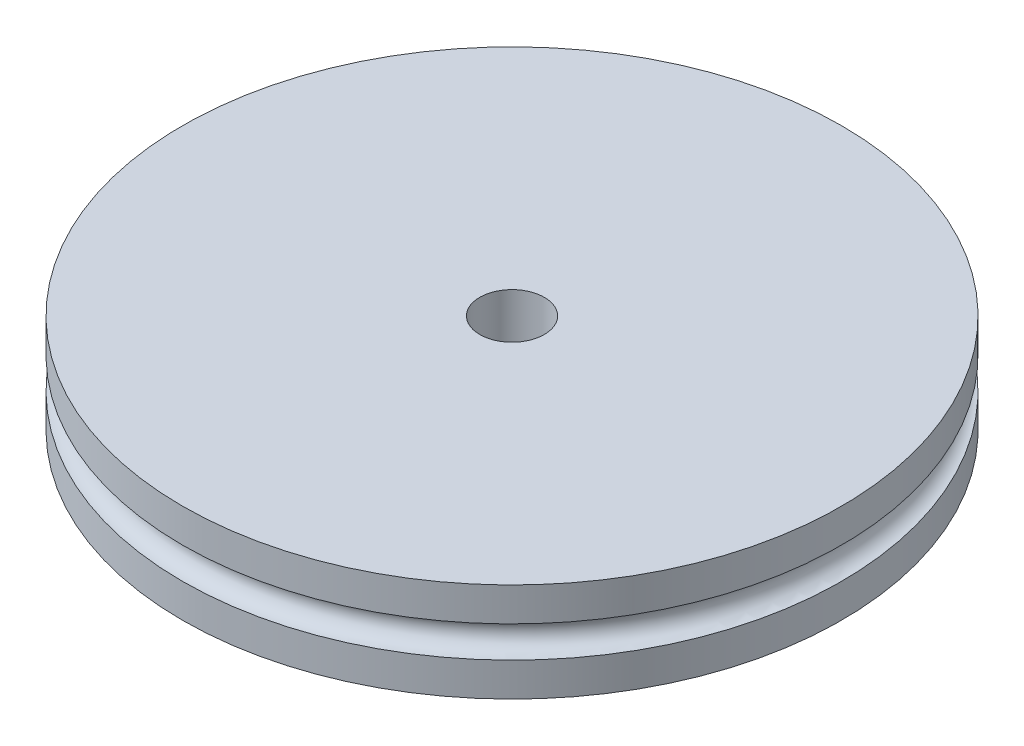
ISO-10303-21;
HEADER;
FILE_DESCRIPTION(('STEP AP214'),'2;1');
FILE_NAME('part.step','',(''),(''),'','','');
FILE_SCHEMA(('AUTOMOTIVE_DESIGN { 1 0 10303 214 1 1 1 1 }'));
ENDSEC;
DATA;
#1=APPLICATION_CONTEXT('core data for automotive mechanical design processes');
#2=APPLICATION_PROTOCOL_DEFINITION('international standard','automotive_design',2000,#1);
#3=PRODUCT_CONTEXT('',#1,'mechanical');
#4=PRODUCT('Part','Part','',(#3));
#5=PRODUCT_RELATED_PRODUCT_CATEGORY('part','',(#4));
#6=PRODUCT_DEFINITION_FORMATION('','',#4);
#7=PRODUCT_DEFINITION_CONTEXT('part definition',#1,'design');
#8=PRODUCT_DEFINITION('design','',#6,#7);
#9=PRODUCT_DEFINITION_SHAPE('','',#8);
#10=(LENGTH_UNIT() NAMED_UNIT(*) SI_UNIT(.MILLI.,.METRE.));
#11=(NAMED_UNIT(*) PLANE_ANGLE_UNIT() SI_UNIT($,.RADIAN.));
#12=(NAMED_UNIT(*) SI_UNIT($,.STERADIAN.) SOLID_ANGLE_UNIT());
#13=UNCERTAINTY_MEASURE_WITH_UNIT(LENGTH_MEASURE(1.E-05),#10,'distance_accuracy_value','');
#14=(GEOMETRIC_REPRESENTATION_CONTEXT(3) GLOBAL_UNCERTAINTY_ASSIGNED_CONTEXT((#13)) GLOBAL_UNIT_ASSIGNED_CONTEXT((#10,
#11,#12)) REPRESENTATION_CONTEXT('',''));
#15=CARTESIAN_POINT('',(0.,0.,0.));
#16=DIRECTION('',(0.,0.,1.));
#17=DIRECTION('',(1.,0.,0.));
#18=AXIS2_PLACEMENT_3D('',#15,#16,#17);
#19=CARTESIAN_POINT('',(0.,10.,0.));
#20=DIRECTION('',(0.,-1.,0.));
#21=DIRECTION('',(0.,0.,-1.));
#22=AXIS2_PLACEMENT_3D('',#19,#20,#21);
#23=CYLINDRICAL_SURFACE('',#22,33.3375);
#24=CARTESIAN_POINT('',(0.,10.,0.));
#25=DIRECTION('',(0.,1.,0.));
#26=DIRECTION('',(0.,0.,1.));
#27=AXIS2_PLACEMENT_3D('',#24,#25,#26);
#28=CIRCLE('',#27,33.3375);
#29=CARTESIAN_POINT('',(0.,10.,33.3375));
#30=VERTEX_POINT('',#29);
#31=EDGE_CURVE('E10',#30,#30,#28,.T.);
#32=ORIENTED_EDGE('',*,*,#31,.F.);
#33=EDGE_LOOP('',(#32));
#34=FACE_BOUND('',#33,.T.);
#35=CARTESIAN_POINT('',(0.,6.58750000000008,0.));
#36=DIRECTION('',(0.,-1.,0.));
#37=DIRECTION('',(0.,0.,-1.));
#38=AXIS2_PLACEMENT_3D('',#35,#36,#37);
#39=CIRCLE('',#38,33.3375);
#40=CARTESIAN_POINT('',(0.,6.58750000000008,-33.3375));
#41=VERTEX_POINT('',#40);
#42=EDGE_CURVE('E36',#41,#41,#39,.T.);
#43=ORIENTED_EDGE('',*,*,#42,.F.);
#44=EDGE_LOOP('',(#43));
#45=FACE_BOUND('',#44,.T.);
#46=ADVANCED_FACE('F33',(#34,#45),#23,.T.);
#47=CARTESIAN_POINT('',(0.,10.,0.));
#48=DIRECTION('',(0.,1.,0.));
#49=DIRECTION('',(0.,0.,1.));
#50=AXIS2_PLACEMENT_3D('',#47,#48,#49);
#51=PLANE('',#50);
#52=CARTESIAN_POINT('',(0.,10.,0.));
#53=DIRECTION('',(0.,1.,0.));
#54=DIRECTION('',(0.,0.,1.));
#55=AXIS2_PLACEMENT_3D('',#52,#53,#54);
#56=CIRCLE('',#55,3.2639);
#57=CARTESIAN_POINT('',(0.,10.,3.2639));
#58=VERTEX_POINT('',#57);
#59=EDGE_CURVE('E55',#58,#58,#56,.T.);
#60=ORIENTED_EDGE('',*,*,#59,.F.);
#61=EDGE_LOOP('',(#60));
#62=FACE_BOUND('',#61,.T.);
#63=ORIENTED_EDGE('',*,*,#31,.T.);
#64=EDGE_LOOP('',(#63));
#65=FACE_BOUND('',#64,.T.);
#66=ADVANCED_FACE('F63',(#62,#65),#51,.T.);
#67=CARTESIAN_POINT('',(0.,5.,0.));
#68=DIRECTION('',(0.,1.,0.));
#69=DIRECTION('',(0.,0.,1.));
#70=AXIS2_PLACEMENT_3D('',#67,#68,#69);
#71=TOROIDAL_SURFACE('',#70,33.3375,1.58750000000008);
#72=CARTESIAN_POINT('',(0.,3.41249999999992,0.));
#73=DIRECTION('',(0.,1.,0.));
#74=DIRECTION('',(0.,0.,1.));
#75=AXIS2_PLACEMENT_3D('',#72,#73,#74);
#76=CIRCLE('',#75,33.3375);
#77=CARTESIAN_POINT('',(0.,3.41249999999992,33.3375));
#78=VERTEX_POINT('',#77);
#79=EDGE_CURVE('E49',#78,#78,#76,.T.);
#80=ORIENTED_EDGE('',*,*,#79,.T.);
#81=EDGE_LOOP('',(#80));
#82=FACE_BOUND('',#81,.T.);
#83=ORIENTED_EDGE('',*,*,#42,.T.);
#84=EDGE_LOOP('',(#83));
#85=FACE_BOUND('',#84,.T.);
#86=ADVANCED_FACE('F65',(#82,#85),#71,.F.);
#87=CARTESIAN_POINT('',(0.,0.,0.));
#88=DIRECTION('',(0.,1.,0.));
#89=DIRECTION('',(0.,0.,1.));
#90=AXIS2_PLACEMENT_3D('',#87,#88,#89);
#91=PLANE('',#90);
#92=CARTESIAN_POINT('',(0.,0.,0.));
#93=DIRECTION('',(0.,1.,0.));
#94=DIRECTION('',(0.,0.,1.));
#95=AXIS2_PLACEMENT_3D('',#92,#93,#94);
#96=CIRCLE('',#95,3.2639);
#97=CARTESIAN_POINT('',(0.,0.,3.2639));
#98=VERTEX_POINT('',#97);
#99=EDGE_CURVE('E47',#98,#98,#96,.T.);
#100=ORIENTED_EDGE('',*,*,#99,.T.);
#101=EDGE_LOOP('',(#100));
#102=FACE_BOUND('',#101,.T.);
#103=CARTESIAN_POINT('',(0.,0.,0.));
#104=DIRECTION('',(0.,1.,0.));
#105=DIRECTION('',(0.,0.,1.));
#106=AXIS2_PLACEMENT_3D('',#103,#104,#105);
#107=CIRCLE('',#106,33.3375);
#108=CARTESIAN_POINT('',(0.,0.,33.3375));
#109=VERTEX_POINT('',#108);
#110=EDGE_CURVE('E40',#109,#109,#107,.T.);
#111=ORIENTED_EDGE('',*,*,#110,.F.);
#112=EDGE_LOOP('',(#111));
#113=FACE_BOUND('',#112,.T.);
#114=ADVANCED_FACE('F72',(#102,#113),#91,.F.);
#115=ORIENTED_EDGE('',*,*,#110,.T.);
#116=EDGE_LOOP('',(#115));
#117=FACE_BOUND('',#116,.T.);
#118=ORIENTED_EDGE('',*,*,#79,.F.);
#119=EDGE_LOOP('',(#118));
#120=FACE_BOUND('',#119,.T.);
#121=ADVANCED_FACE('F76',(#117,#120),#23,.T.);
#122=CARTESIAN_POINT('',(0.,10.,0.));
#123=DIRECTION('',(0.,1.,0.));
#124=DIRECTION('',(0.,0.,1.));
#125=AXIS2_PLACEMENT_3D('',#122,#123,#124);
#126=CYLINDRICAL_SURFACE('',#125,3.2639);
#127=ORIENTED_EDGE('',*,*,#99,.F.);
#128=EDGE_LOOP('',(#127));
#129=FACE_BOUND('',#128,.T.);
#130=ORIENTED_EDGE('',*,*,#59,.T.);
#131=EDGE_LOOP('',(#130));
#132=FACE_BOUND('',#131,.T.);
#133=ADVANCED_FACE('F61',(#129,#132),#126,.F.);
#134=CLOSED_SHELL('',(#46,#66,#86,#114,#121,#133));
#135=MANIFOLD_SOLID_BREP('B2',#134);
#136=ADVANCED_BREP_SHAPE_REPRESENTATION('',(#18,#135),#14);
#137=SHAPE_DEFINITION_REPRESENTATION(#9,#136);
ENDSEC;
END-ISO-10303-21;
